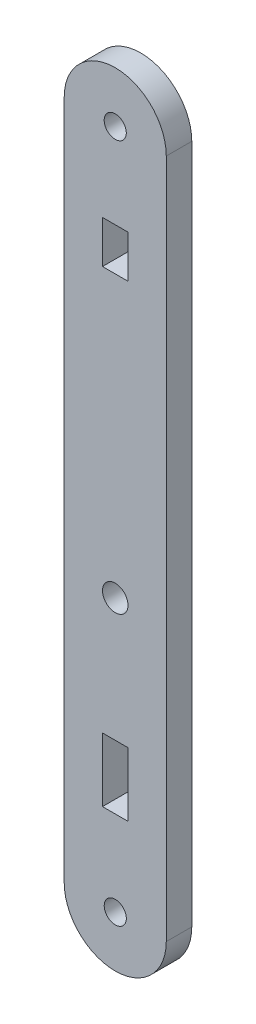
ISO-10303-21;
HEADER;
FILE_DESCRIPTION(('STEP AP214'),'2;1');
FILE_NAME('part.step','',(''),(''),'','','');
FILE_SCHEMA(('AUTOMOTIVE_DESIGN { 1 0 10303 214 1 1 1 1 }'));
ENDSEC;
DATA;
#1=APPLICATION_CONTEXT('core data for automotive mechanical design processes');
#2=APPLICATION_PROTOCOL_DEFINITION('international standard','automotive_design',2000,#1);
#3=PRODUCT_CONTEXT('',#1,'mechanical');
#4=PRODUCT('Part','Part','',(#3));
#5=PRODUCT_RELATED_PRODUCT_CATEGORY('part','',(#4));
#6=PRODUCT_DEFINITION_FORMATION('','',#4);
#7=PRODUCT_DEFINITION_CONTEXT('part definition',#1,'design');
#8=PRODUCT_DEFINITION('design','',#6,#7);
#9=PRODUCT_DEFINITION_SHAPE('','',#8);
#10=(LENGTH_UNIT() NAMED_UNIT(*) SI_UNIT(.MILLI.,.METRE.));
#11=(NAMED_UNIT(*) PLANE_ANGLE_UNIT() SI_UNIT($,.RADIAN.));
#12=(NAMED_UNIT(*) SI_UNIT($,.STERADIAN.) SOLID_ANGLE_UNIT());
#13=UNCERTAINTY_MEASURE_WITH_UNIT(LENGTH_MEASURE(1.E-05),#10,'distance_accuracy_value','');
#14=(GEOMETRIC_REPRESENTATION_CONTEXT(3) GLOBAL_UNCERTAINTY_ASSIGNED_CONTEXT((#13)) GLOBAL_UNIT_ASSIGNED_CONTEXT((#10,
#11,#12)) REPRESENTATION_CONTEXT('',''));
#15=CARTESIAN_POINT('',(0.,0.,0.));
#16=DIRECTION('',(0.,0.,1.));
#17=DIRECTION('',(1.,0.,0.));
#18=AXIS2_PLACEMENT_3D('',#15,#16,#17);
#19=CARTESIAN_POINT('',(55.1439999961535,78.2315737884063,3.));
#20=DIRECTION('',(0.,0.,1.));
#21=DIRECTION('',(1.,0.,0.));
#22=AXIS2_PLACEMENT_3D('',#19,#20,#21);
#23=PLANE('',#22);
#24=CARTESIAN_POINT('',(55.1471580515541,-1.76144448478704,3.));
#25=DIRECTION('',(0.,0.,1.));
#26=DIRECTION('',(1.,0.,0.));
#27=AXIS2_PLACEMENT_3D('',#24,#25,#26);
#28=CIRCLE('',#27,1.30000000000001);
#29=CARTESIAN_POINT('',(56.4471580515541,-1.76144448478704,3.));
#30=VERTEX_POINT('',#29);
#31=EDGE_CURVE('E197',#30,#30,#28,.T.);
#32=ORIENTED_EDGE('',*,*,#31,.F.);
#33=EDGE_LOOP('',(#32));
#34=FACE_BOUND('',#33,.T.);
#35=CARTESIAN_POINT('',(55.1439999961535,78.2315737884063,3.));
#36=DIRECTION('',(0.,0.,1.));
#37=DIRECTION('',(1.,0.,0.));
#38=AXIS2_PLACEMENT_3D('',#35,#36,#37);
#39=CIRCLE('',#38,6.00000000000001);
#40=CARTESIAN_POINT('',(61.1439999961535,78.2315737884199,3.));
#41=VERTEX_POINT('',#40);
#42=CARTESIAN_POINT('',(49.1439999961534,78.2315737883927,3.));
#43=VERTEX_POINT('',#42);
#44=EDGE_CURVE('E209',#41,#43,#39,.T.);
#45=ORIENTED_EDGE('',*,*,#44,.T.);
#46=DIRECTION('',(0.,-1.,0.));
#47=VECTOR('',#46,1.);
#48=CARTESIAN_POINT('',(49.1439999961534,78.2315737883927,3.));
#49=LINE('',#48,#47);
#50=CARTESIAN_POINT('',(49.1439999961534,-1.76842621166531,3.));
#51=VERTEX_POINT('',#50);
#52=EDGE_CURVE('E212',#43,#51,#49,.T.);
#53=ORIENTED_EDGE('',*,*,#52,.T.);
#54=CARTESIAN_POINT('',(55.1439999961535,-1.76847621164486,3.));
#55=DIRECTION('',(0.,0.,1.));
#56=DIRECTION('',(1.,0.,0.));
#57=AXIS2_PLACEMENT_3D('',#54,#55,#56);
#58=CIRCLE('',#57,6.00000000020835);
#59=CARTESIAN_POINT('',(61.1439999961535,-1.76852621162442,3.));
#60=VERTEX_POINT('',#59);
#61=EDGE_CURVE('E215',#51,#60,#58,.T.);
#62=ORIENTED_EDGE('',*,*,#61,.T.);
#63=DIRECTION('',(0.,1.,0.));
#64=VECTOR('',#63,1.);
#65=CARTESIAN_POINT('',(61.1439999961535,-1.76852621162442,3.));
#66=LINE('',#65,#64);
#67=EDGE_CURVE('E217',#60,#41,#66,.T.);
#68=ORIENTED_EDGE('',*,*,#67,.T.);
#69=EDGE_LOOP('',(#45,#53,#62,#68));
#70=FACE_BOUND('',#69,.T.);
#71=CARTESIAN_POINT('',(55.144,30.2314737883921,3.));
#72=DIRECTION('',(0.,0.,1.));
#73=DIRECTION('',(1.,0.,0.));
#74=AXIS2_PLACEMENT_3D('',#71,#72,#73);
#75=CIRCLE('',#74,1.50000000000001);
#76=CARTESIAN_POINT('',(56.644,30.2314737883921,3.));
#77=VERTEX_POINT('',#76);
#78=EDGE_CURVE('E203',#77,#77,#75,.T.);
#79=ORIENTED_EDGE('',*,*,#78,.F.);
#80=EDGE_LOOP('',(#79));
#81=FACE_BOUND('',#80,.T.);
#82=CARTESIAN_POINT('',(55.1439999961535,78.2315737884063,3.));
#83=DIRECTION('',(0.,0.,1.));
#84=DIRECTION('',(1.,0.,0.));
#85=AXIS2_PLACEMENT_3D('',#82,#83,#84);
#86=CIRCLE('',#85,1.30000000384647);
#87=CARTESIAN_POINT('',(56.4439999999999,78.2315737884063,3.));
#88=VERTEX_POINT('',#87);
#89=EDGE_CURVE('E191',#88,#88,#86,.T.);
#90=ORIENTED_EDGE('',*,*,#89,.F.);
#91=EDGE_LOOP('',(#90));
#92=FACE_BOUND('',#91,.T.);
#93=DIRECTION('',(1.,0.,0.));
#94=VECTOR('',#93,1.);
#95=CARTESIAN_POINT('',(56.644,63.2315737883927,3.));
#96=LINE('',#95,#94);
#97=CARTESIAN_POINT('',(53.644,63.2315737883928,3.));
#98=VERTEX_POINT('',#97);
#99=CARTESIAN_POINT('',(56.644,63.2315737883927,3.));
#100=VERTEX_POINT('',#99);
#101=EDGE_CURVE('E162',#98,#100,#96,.T.);
#102=ORIENTED_EDGE('',*,*,#101,.F.);
#103=DIRECTION('',(0.,-1.,0.));
#104=VECTOR('',#103,1.);
#105=CARTESIAN_POINT('',(53.644,68.2315737883927,3.));
#106=LINE('',#105,#104);
#107=CARTESIAN_POINT('',(53.644,68.2315737883927,3.));
#108=VERTEX_POINT('',#107);
#109=EDGE_CURVE('E160',#108,#98,#106,.T.);
#110=ORIENTED_EDGE('',*,*,#109,.F.);
#111=DIRECTION('',(-1.,0.,0.));
#112=VECTOR('',#111,1.);
#113=CARTESIAN_POINT('',(53.644,68.2315737883927,3.));
#114=LINE('',#113,#112);
#115=CARTESIAN_POINT('',(56.644,68.2315737883928,3.));
#116=VERTEX_POINT('',#115);
#117=EDGE_CURVE('E168',#116,#108,#114,.T.);
#118=ORIENTED_EDGE('',*,*,#117,.F.);
#119=DIRECTION('',(0.,1.,0.));
#120=VECTOR('',#119,1.);
#121=CARTESIAN_POINT('',(56.644,63.2315737883927,3.));
#122=LINE('',#121,#120);
#123=EDGE_CURVE('E165',#100,#116,#122,.T.);
#124=ORIENTED_EDGE('',*,*,#123,.F.);
#125=EDGE_LOOP('',(#102,#110,#118,#124));
#126=FACE_BOUND('',#125,.T.);
#127=DIRECTION('',(-1.,0.,0.));
#128=VECTOR('',#127,1.);
#129=CARTESIAN_POINT('',(56.644,15.7315737883927,3.));
#130=LINE('',#129,#128);
#131=CARTESIAN_POINT('',(56.644,15.7315737883927,3.));
#132=VERTEX_POINT('',#131);
#133=CARTESIAN_POINT('',(53.644,15.7315737883927,3.));
#134=VERTEX_POINT('',#133);
#135=EDGE_CURVE('E132',#132,#134,#130,.T.);
#136=ORIENTED_EDGE('',*,*,#135,.F.);
#137=DIRECTION('',(0.,1.,0.));
#138=VECTOR('',#137,1.);
#139=CARTESIAN_POINT('',(56.644,8.23157378839274,3.));
#140=LINE('',#139,#138);
#141=CARTESIAN_POINT('',(56.644,8.23157378839274,3.));
#142=VERTEX_POINT('',#141);
#143=EDGE_CURVE('E124',#142,#132,#140,.T.);
#144=ORIENTED_EDGE('',*,*,#143,.F.);
#145=DIRECTION('',(1.,0.,0.));
#146=VECTOR('',#145,1.);
#147=CARTESIAN_POINT('',(56.644,8.23157378839274,3.));
#148=LINE('',#147,#146);
#149=CARTESIAN_POINT('',(53.644,8.23157378839275,3.));
#150=VERTEX_POINT('',#149);
#151=EDGE_CURVE('E146',#150,#142,#148,.T.);
#152=ORIENTED_EDGE('',*,*,#151,.F.);
#153=DIRECTION('',(0.,-1.,0.));
#154=VECTOR('',#153,1.);
#155=CARTESIAN_POINT('',(53.644,8.23157378839275,3.));
#156=LINE('',#155,#154);
#157=EDGE_CURVE('E144',#134,#150,#156,.T.);
#158=ORIENTED_EDGE('',*,*,#157,.F.);
#159=EDGE_LOOP('',(#136,#144,#152,#158));
#160=FACE_BOUND('',#159,.T.);
#161=ADVANCED_FACE('F35',(#34,#70,#81,#92,#126,#160),#23,.T.);
#162=CARTESIAN_POINT('',(55.1439999961535,78.2315737884063,0.));
#163=DIRECTION('',(0.,0.,1.));
#164=DIRECTION('',(1.,0.,0.));
#165=AXIS2_PLACEMENT_3D('',#162,#163,#164);
#166=PLANE('',#165);
#167=DIRECTION('',(0.,-1.,0.));
#168=VECTOR('',#167,1.);
#169=CARTESIAN_POINT('',(53.644,68.2315737883927,0.));
#170=LINE('',#169,#168);
#171=CARTESIAN_POINT('',(53.644,68.2315737883927,0.));
#172=VERTEX_POINT('',#171);
#173=CARTESIAN_POINT('',(53.644,63.2315737883928,0.));
#174=VERTEX_POINT('',#173);
#175=EDGE_CURVE('E140',#172,#174,#170,.T.);
#176=ORIENTED_EDGE('',*,*,#175,.T.);
#177=DIRECTION('',(1.,0.,0.));
#178=VECTOR('',#177,1.);
#179=CARTESIAN_POINT('',(56.644,63.2315737883927,0.));
#180=LINE('',#179,#178);
#181=CARTESIAN_POINT('',(56.644,63.2315737883927,0.));
#182=VERTEX_POINT('',#181);
#183=EDGE_CURVE('E173',#174,#182,#180,.T.);
#184=ORIENTED_EDGE('',*,*,#183,.T.);
#185=DIRECTION('',(0.,1.,0.));
#186=VECTOR('',#185,1.);
#187=CARTESIAN_POINT('',(56.644,63.2315737883927,0.));
#188=LINE('',#187,#186);
#189=CARTESIAN_POINT('',(56.644,68.2315737883928,0.));
#190=VERTEX_POINT('',#189);
#191=EDGE_CURVE('E176',#182,#190,#188,.T.);
#192=ORIENTED_EDGE('',*,*,#191,.T.);
#193=DIRECTION('',(-1.,0.,0.));
#194=VECTOR('',#193,1.);
#195=CARTESIAN_POINT('',(53.644,68.2315737883927,0.));
#196=LINE('',#195,#194);
#197=EDGE_CURVE('E163',#190,#172,#196,.T.);
#198=ORIENTED_EDGE('',*,*,#197,.T.);
#199=EDGE_LOOP('',(#176,#184,#192,#198));
#200=FACE_BOUND('',#199,.T.);
#201=CARTESIAN_POINT('',(55.1439999961535,78.2315737884063,0.));
#202=DIRECTION('',(0.,0.,1.));
#203=DIRECTION('',(1.,0.,0.));
#204=AXIS2_PLACEMENT_3D('',#201,#202,#203);
#205=CIRCLE('',#204,6.00000000000001);
#206=CARTESIAN_POINT('',(61.1439999961535,78.2315737884199,0.));
#207=VERTEX_POINT('',#206);
#208=CARTESIAN_POINT('',(49.1439999961534,78.2315737883927,0.));
#209=VERTEX_POINT('',#208);
#210=EDGE_CURVE('E206',#207,#209,#205,.T.);
#211=ORIENTED_EDGE('',*,*,#210,.F.);
#212=DIRECTION('',(0.,1.,0.));
#213=VECTOR('',#212,1.);
#214=CARTESIAN_POINT('',(61.1439999961535,-1.76852621162442,0.));
#215=LINE('',#214,#213);
#216=CARTESIAN_POINT('',(61.1439999961535,-1.76852621162442,0.));
#217=VERTEX_POINT('',#216);
#218=EDGE_CURVE('E213',#217,#207,#215,.T.);
#219=ORIENTED_EDGE('',*,*,#218,.F.);
#220=CARTESIAN_POINT('',(55.1439999961535,-1.76847621164486,0.));
#221=DIRECTION('',(0.,0.,1.));
#222=DIRECTION('',(1.,0.,0.));
#223=AXIS2_PLACEMENT_3D('',#220,#221,#222);
#224=CIRCLE('',#223,6.00000000020835);
#225=CARTESIAN_POINT('',(49.1439999961534,-1.76842621166531,0.));
#226=VERTEX_POINT('',#225);
#227=EDGE_CURVE('E224',#226,#217,#224,.T.);
#228=ORIENTED_EDGE('',*,*,#227,.F.);
#229=DIRECTION('',(0.,-1.,0.));
#230=VECTOR('',#229,1.);
#231=CARTESIAN_POINT('',(49.1439999961534,78.2315737883927,0.));
#232=LINE('',#231,#230);
#233=EDGE_CURVE('E222',#209,#226,#232,.T.);
#234=ORIENTED_EDGE('',*,*,#233,.F.);
#235=EDGE_LOOP('',(#211,#219,#228,#234));
#236=FACE_BOUND('',#235,.T.);
#237=CARTESIAN_POINT('',(55.144,30.2314737883921,0.));
#238=DIRECTION('',(0.,0.,1.));
#239=DIRECTION('',(1.,0.,0.));
#240=AXIS2_PLACEMENT_3D('',#237,#238,#239);
#241=CIRCLE('',#240,1.50000000000001);
#242=CARTESIAN_POINT('',(56.644,30.2314737883921,0.));
#243=VERTEX_POINT('',#242);
#244=EDGE_CURVE('E200',#243,#243,#241,.T.);
#245=ORIENTED_EDGE('',*,*,#244,.T.);
#246=EDGE_LOOP('',(#245));
#247=FACE_BOUND('',#246,.T.);
#248=CARTESIAN_POINT('',(55.1471580515541,-1.76144448478704,0.));
#249=DIRECTION('',(0.,0.,1.));
#250=DIRECTION('',(1.,0.,0.));
#251=AXIS2_PLACEMENT_3D('',#248,#249,#250);
#252=CIRCLE('',#251,1.30000000000001);
#253=CARTESIAN_POINT('',(56.4471580515541,-1.76144448478704,0.));
#254=VERTEX_POINT('',#253);
#255=EDGE_CURVE('E194',#254,#254,#252,.T.);
#256=ORIENTED_EDGE('',*,*,#255,.T.);
#257=EDGE_LOOP('',(#256));
#258=FACE_BOUND('',#257,.T.);
#259=CARTESIAN_POINT('',(55.1439999961535,78.2315737884063,0.));
#260=DIRECTION('',(0.,0.,1.));
#261=DIRECTION('',(1.,0.,0.));
#262=AXIS2_PLACEMENT_3D('',#259,#260,#261);
#263=CIRCLE('',#262,1.30000000384647);
#264=CARTESIAN_POINT('',(56.4439999999999,78.2315737884063,0.));
#265=VERTEX_POINT('',#264);
#266=EDGE_CURVE('E190',#265,#265,#263,.T.);
#267=ORIENTED_EDGE('',*,*,#266,.T.);
#268=EDGE_LOOP('',(#267));
#269=FACE_BOUND('',#268,.T.);
#270=DIRECTION('',(0.,1.,0.));
#271=VECTOR('',#270,1.);
#272=CARTESIAN_POINT('',(56.644,8.23157378839274,0.));
#273=LINE('',#272,#271);
#274=CARTESIAN_POINT('',(56.644,8.23157378839274,0.));
#275=VERTEX_POINT('',#274);
#276=CARTESIAN_POINT('',(56.644,15.7315737883927,0.));
#277=VERTEX_POINT('',#276);
#278=EDGE_CURVE('E58',#275,#277,#273,.T.);
#279=ORIENTED_EDGE('',*,*,#278,.T.);
#280=DIRECTION('',(-1.,0.,0.));
#281=VECTOR('',#280,1.);
#282=CARTESIAN_POINT('',(56.644,15.7315737883927,0.));
#283=LINE('',#282,#281);
#284=CARTESIAN_POINT('',(53.644,15.7315737883927,0.));
#285=VERTEX_POINT('',#284);
#286=EDGE_CURVE('E139',#277,#285,#283,.T.);
#287=ORIENTED_EDGE('',*,*,#286,.T.);
#288=DIRECTION('',(0.,-1.,0.));
#289=VECTOR('',#288,1.);
#290=CARTESIAN_POINT('',(53.644,8.23157378839275,0.));
#291=LINE('',#290,#289);
#292=CARTESIAN_POINT('',(53.644,8.23157378839275,0.));
#293=VERTEX_POINT('',#292);
#294=EDGE_CURVE('E152',#285,#293,#291,.T.);
#295=ORIENTED_EDGE('',*,*,#294,.T.);
#296=DIRECTION('',(1.,0.,0.));
#297=VECTOR('',#296,1.);
#298=CARTESIAN_POINT('',(56.644,8.23157378839274,0.));
#299=LINE('',#298,#297);
#300=EDGE_CURVE('E133',#293,#275,#299,.T.);
#301=ORIENTED_EDGE('',*,*,#300,.T.);
#302=EDGE_LOOP('',(#279,#287,#295,#301));
#303=FACE_BOUND('',#302,.T.);
#304=ADVANCED_FACE('F242',(#200,#236,#247,#258,#269,#303),#166,.F.);
#305=CARTESIAN_POINT('',(55.1439999961535,78.2315737884063,3.));
#306=DIRECTION('',(0.,0.,-1.));
#307=DIRECTION('',(-1.,0.,0.));
#308=AXIS2_PLACEMENT_3D('',#305,#306,#307);
#309=CYLINDRICAL_SURFACE('',#308,6.00000000000001);
#310=ORIENTED_EDGE('',*,*,#210,.T.);
#311=DIRECTION('',(0.,0.,-1.));
#312=VECTOR('',#311,1.);
#313=CARTESIAN_POINT('',(49.1439999961534,78.2315737883927,3.));
#314=LINE('',#313,#312);
#315=EDGE_CURVE('E11',#43,#209,#314,.T.);
#316=ORIENTED_EDGE('',*,*,#315,.F.);
#317=ORIENTED_EDGE('',*,*,#44,.F.);
#318=DIRECTION('',(0.,0.,-1.));
#319=VECTOR('',#318,1.);
#320=CARTESIAN_POINT('',(61.1439999961535,78.2315737884199,3.));
#321=LINE('',#320,#319);
#322=EDGE_CURVE('E219',#41,#207,#321,.T.);
#323=ORIENTED_EDGE('',*,*,#322,.T.);
#324=EDGE_LOOP('',(#310,#316,#317,#323));
#325=FACE_BOUND('',#324,.T.);
#326=ADVANCED_FACE('F37',(#325),#309,.T.);
#327=CARTESIAN_POINT('',(49.1439999961534,78.2315737883927,3.));
#328=DIRECTION('',(1.,0.,0.));
#329=DIRECTION('',(0.,0.,-1.));
#330=AXIS2_PLACEMENT_3D('',#327,#328,#329);
#331=PLANE('',#330);
#332=ORIENTED_EDGE('',*,*,#233,.T.);
#333=DIRECTION('',(0.,0.,-1.));
#334=VECTOR('',#333,1.);
#335=CARTESIAN_POINT('',(49.1439999961534,-1.76842621166531,3.));
#336=LINE('',#335,#334);
#337=EDGE_CURVE('E43',#51,#226,#336,.T.);
#338=ORIENTED_EDGE('',*,*,#337,.F.);
#339=ORIENTED_EDGE('',*,*,#52,.F.);
#340=ORIENTED_EDGE('',*,*,#315,.T.);
#341=EDGE_LOOP('',(#332,#338,#339,#340));
#342=FACE_BOUND('',#341,.T.);
#343=ADVANCED_FACE('F253',(#342),#331,.F.);
#344=CARTESIAN_POINT('',(55.1439999961535,-1.76847621164486,3.));
#345=DIRECTION('',(0.,0.,-1.));
#346=DIRECTION('',(-1.,0.,0.));
#347=AXIS2_PLACEMENT_3D('',#344,#345,#346);
#348=CYLINDRICAL_SURFACE('',#347,6.00000000020835);
#349=ORIENTED_EDGE('',*,*,#227,.T.);
#350=DIRECTION('',(0.,0.,-1.));
#351=VECTOR('',#350,1.);
#352=CARTESIAN_POINT('',(61.1439999961535,-1.76852621162442,3.));
#353=LINE('',#352,#351);
#354=EDGE_CURVE('E229',#60,#217,#353,.T.);
#355=ORIENTED_EDGE('',*,*,#354,.F.);
#356=ORIENTED_EDGE('',*,*,#61,.F.);
#357=ORIENTED_EDGE('',*,*,#337,.T.);
#358=EDGE_LOOP('',(#349,#355,#356,#357));
#359=FACE_BOUND('',#358,.T.);
#360=ADVANCED_FACE('F236',(#359),#348,.T.);
#361=CARTESIAN_POINT('',(61.1439999961535,-1.76852621162442,3.));
#362=DIRECTION('',(-1.,0.,0.));
#363=DIRECTION('',(0.,0.,1.));
#364=AXIS2_PLACEMENT_3D('',#361,#362,#363);
#365=PLANE('',#364);
#366=ORIENTED_EDGE('',*,*,#218,.T.);
#367=ORIENTED_EDGE('',*,*,#322,.F.);
#368=ORIENTED_EDGE('',*,*,#67,.F.);
#369=ORIENTED_EDGE('',*,*,#354,.T.);
#370=EDGE_LOOP('',(#366,#367,#368,#369));
#371=FACE_BOUND('',#370,.T.);
#372=ADVANCED_FACE('F246',(#371),#365,.F.);
#373=CARTESIAN_POINT('',(55.144,30.2314737883921,3.));
#374=DIRECTION('',(0.,0.,-1.));
#375=DIRECTION('',(-1.,0.,0.));
#376=AXIS2_PLACEMENT_3D('',#373,#374,#375);
#377=CYLINDRICAL_SURFACE('',#376,1.50000000000001);
#378=ORIENTED_EDGE('',*,*,#78,.T.);
#379=EDGE_LOOP('',(#378));
#380=FACE_BOUND('',#379,.T.);
#381=ORIENTED_EDGE('',*,*,#244,.F.);
#382=EDGE_LOOP('',(#381));
#383=FACE_BOUND('',#382,.T.);
#384=ADVANCED_FACE('F270',(#380,#383),#377,.F.);
#385=CARTESIAN_POINT('',(55.1471580515541,-1.76144448478704,3.));
#386=DIRECTION('',(0.,0.,-1.));
#387=DIRECTION('',(-1.,0.,0.));
#388=AXIS2_PLACEMENT_3D('',#385,#386,#387);
#389=CYLINDRICAL_SURFACE('',#388,1.30000000000001);
#390=ORIENTED_EDGE('',*,*,#31,.T.);
#391=EDGE_LOOP('',(#390));
#392=FACE_BOUND('',#391,.T.);
#393=ORIENTED_EDGE('',*,*,#255,.F.);
#394=EDGE_LOOP('',(#393));
#395=FACE_BOUND('',#394,.T.);
#396=ADVANCED_FACE('F277',(#392,#395),#389,.F.);
#397=CARTESIAN_POINT('',(55.1439999961535,78.2315737884063,3.));
#398=DIRECTION('',(0.,0.,-1.));
#399=DIRECTION('',(-1.,0.,0.));
#400=AXIS2_PLACEMENT_3D('',#397,#398,#399);
#401=CYLINDRICAL_SURFACE('',#400,1.30000000384647);
#402=ORIENTED_EDGE('',*,*,#89,.T.);
#403=EDGE_LOOP('',(#402));
#404=FACE_BOUND('',#403,.T.);
#405=ORIENTED_EDGE('',*,*,#266,.F.);
#406=EDGE_LOOP('',(#405));
#407=FACE_BOUND('',#406,.T.);
#408=ADVANCED_FACE('F282',(#404,#407),#401,.F.);
#409=CARTESIAN_POINT('',(53.644,68.2315737883927,3.));
#410=DIRECTION('',(1.,0.,0.));
#411=DIRECTION('',(0.,0.,-1.));
#412=AXIS2_PLACEMENT_3D('',#409,#410,#411);
#413=PLANE('',#412);
#414=ORIENTED_EDGE('',*,*,#175,.F.);
#415=DIRECTION('',(0.,0.,-1.));
#416=VECTOR('',#415,1.);
#417=CARTESIAN_POINT('',(53.644,68.2315737883927,3.));
#418=LINE('',#417,#416);
#419=EDGE_CURVE('E170',#108,#172,#418,.T.);
#420=ORIENTED_EDGE('',*,*,#419,.F.);
#421=ORIENTED_EDGE('',*,*,#109,.T.);
#422=DIRECTION('',(0.,0.,-1.));
#423=VECTOR('',#422,1.);
#424=CARTESIAN_POINT('',(53.644,63.2315737883928,3.));
#425=LINE('',#424,#423);
#426=EDGE_CURVE('E187',#98,#174,#425,.T.);
#427=ORIENTED_EDGE('',*,*,#426,.T.);
#428=EDGE_LOOP('',(#414,#420,#421,#427));
#429=FACE_BOUND('',#428,.T.);
#430=ADVANCED_FACE('F318',(#429),#413,.T.);
#431=CARTESIAN_POINT('',(56.644,63.2315737883927,3.));
#432=DIRECTION('',(0.,1.,0.));
#433=DIRECTION('',(-1.,0.,0.));
#434=AXIS2_PLACEMENT_3D('',#431,#432,#433);
#435=PLANE('',#434);
#436=ORIENTED_EDGE('',*,*,#183,.F.);
#437=ORIENTED_EDGE('',*,*,#426,.F.);
#438=ORIENTED_EDGE('',*,*,#101,.T.);
#439=DIRECTION('',(0.,0.,-1.));
#440=VECTOR('',#439,1.);
#441=CARTESIAN_POINT('',(56.644,63.2315737883927,3.));
#442=LINE('',#441,#440);
#443=EDGE_CURVE('E185',#100,#182,#442,.T.);
#444=ORIENTED_EDGE('',*,*,#443,.T.);
#445=EDGE_LOOP('',(#436,#437,#438,#444));
#446=FACE_BOUND('',#445,.T.);
#447=ADVANCED_FACE('F314',(#446),#435,.T.);
#448=CARTESIAN_POINT('',(56.644,63.2315737883927,3.));
#449=DIRECTION('',(-1.,0.,0.));
#450=DIRECTION('',(0.,0.,1.));
#451=AXIS2_PLACEMENT_3D('',#448,#449,#450);
#452=PLANE('',#451);
#453=ORIENTED_EDGE('',*,*,#191,.F.);
#454=ORIENTED_EDGE('',*,*,#443,.F.);
#455=ORIENTED_EDGE('',*,*,#123,.T.);
#456=DIRECTION('',(0.,0.,-1.));
#457=VECTOR('',#456,1.);
#458=CARTESIAN_POINT('',(56.644,68.2315737883928,3.));
#459=LINE('',#458,#457);
#460=EDGE_CURVE('E183',#116,#190,#459,.T.);
#461=ORIENTED_EDGE('',*,*,#460,.T.);
#462=EDGE_LOOP('',(#453,#454,#455,#461));
#463=FACE_BOUND('',#462,.T.);
#464=ADVANCED_FACE('F310',(#463),#452,.T.);
#465=CARTESIAN_POINT('',(53.644,68.2315737883927,3.));
#466=DIRECTION('',(0.,-1.,0.));
#467=DIRECTION('',(1.,0.,0.));
#468=AXIS2_PLACEMENT_3D('',#465,#466,#467);
#469=PLANE('',#468);
#470=ORIENTED_EDGE('',*,*,#197,.F.);
#471=ORIENTED_EDGE('',*,*,#460,.F.);
#472=ORIENTED_EDGE('',*,*,#117,.T.);
#473=ORIENTED_EDGE('',*,*,#419,.T.);
#474=EDGE_LOOP('',(#470,#471,#472,#473));
#475=FACE_BOUND('',#474,.T.);
#476=ADVANCED_FACE('F307',(#475),#469,.T.);
#477=CARTESIAN_POINT('',(56.644,8.23157378839274,3.));
#478=DIRECTION('',(-1.,0.,0.));
#479=DIRECTION('',(0.,0.,1.));
#480=AXIS2_PLACEMENT_3D('',#477,#478,#479);
#481=PLANE('',#480);
#482=ORIENTED_EDGE('',*,*,#278,.F.);
#483=DIRECTION('',(0.,0.,-1.));
#484=VECTOR('',#483,1.);
#485=CARTESIAN_POINT('',(56.644,8.23157378839274,3.));
#486=LINE('',#485,#484);
#487=EDGE_CURVE('E128',#142,#275,#486,.T.);
#488=ORIENTED_EDGE('',*,*,#487,.F.);
#489=ORIENTED_EDGE('',*,*,#143,.T.);
#490=DIRECTION('',(0.,0.,-1.));
#491=VECTOR('',#490,1.);
#492=CARTESIAN_POINT('',(56.644,15.7315737883927,3.));
#493=LINE('',#492,#491);
#494=EDGE_CURVE('E127',#132,#277,#493,.T.);
#495=ORIENTED_EDGE('',*,*,#494,.T.);
#496=EDGE_LOOP('',(#482,#488,#489,#495));
#497=FACE_BOUND('',#496,.T.);
#498=ADVANCED_FACE('F126',(#497),#481,.T.);
#499=CARTESIAN_POINT('',(56.644,15.7315737883927,3.));
#500=DIRECTION('',(0.,-1.,0.));
#501=DIRECTION('',(0.,0.,-1.));
#502=AXIS2_PLACEMENT_3D('',#499,#500,#501);
#503=PLANE('',#502);
#504=ORIENTED_EDGE('',*,*,#286,.F.);
#505=ORIENTED_EDGE('',*,*,#494,.F.);
#506=ORIENTED_EDGE('',*,*,#135,.T.);
#507=DIRECTION('',(0.,0.,-1.));
#508=VECTOR('',#507,1.);
#509=CARTESIAN_POINT('',(53.644,15.7315737883927,3.));
#510=LINE('',#509,#508);
#511=EDGE_CURVE('E141',#134,#285,#510,.T.);
#512=ORIENTED_EDGE('',*,*,#511,.T.);
#513=EDGE_LOOP('',(#504,#505,#506,#512));
#514=FACE_BOUND('',#513,.T.);
#515=ADVANCED_FACE('F136',(#514),#503,.T.);
#516=CARTESIAN_POINT('',(53.644,8.23157378839275,3.));
#517=DIRECTION('',(1.,0.,0.));
#518=DIRECTION('',(0.,0.,-1.));
#519=AXIS2_PLACEMENT_3D('',#516,#517,#518);
#520=PLANE('',#519);
#521=ORIENTED_EDGE('',*,*,#294,.F.);
#522=ORIENTED_EDGE('',*,*,#511,.F.);
#523=ORIENTED_EDGE('',*,*,#157,.T.);
#524=DIRECTION('',(0.,0.,-1.));
#525=VECTOR('',#524,1.);
#526=CARTESIAN_POINT('',(53.644,8.23157378839275,3.));
#527=LINE('',#526,#525);
#528=EDGE_CURVE('E50',#150,#293,#527,.T.);
#529=ORIENTED_EDGE('',*,*,#528,.T.);
#530=EDGE_LOOP('',(#521,#522,#523,#529));
#531=FACE_BOUND('',#530,.T.);
#532=ADVANCED_FACE('F295',(#531),#520,.T.);
#533=CARTESIAN_POINT('',(56.644,8.23157378839274,3.));
#534=DIRECTION('',(0.,1.,0.));
#535=DIRECTION('',(-1.,0.,0.));
#536=AXIS2_PLACEMENT_3D('',#533,#534,#535);
#537=PLANE('',#536);
#538=ORIENTED_EDGE('',*,*,#300,.F.);
#539=ORIENTED_EDGE('',*,*,#528,.F.);
#540=ORIENTED_EDGE('',*,*,#151,.T.);
#541=ORIENTED_EDGE('',*,*,#487,.T.);
#542=EDGE_LOOP('',(#538,#539,#540,#541));
#543=FACE_BOUND('',#542,.T.);
#544=ADVANCED_FACE('F293',(#543),#537,.T.);
#545=CLOSED_SHELL('',(#161,#304,#326,#343,#360,#372,#384,#396,#408,#430,#447,#464,#476,#498,
#515,#532,#544));
#546=MANIFOLD_SOLID_BREP('B2',#545);
#547=ADVANCED_BREP_SHAPE_REPRESENTATION('',(#18,#546),#14);
#548=SHAPE_DEFINITION_REPRESENTATION(#9,#547);
ENDSEC;
END-ISO-10303-21;
